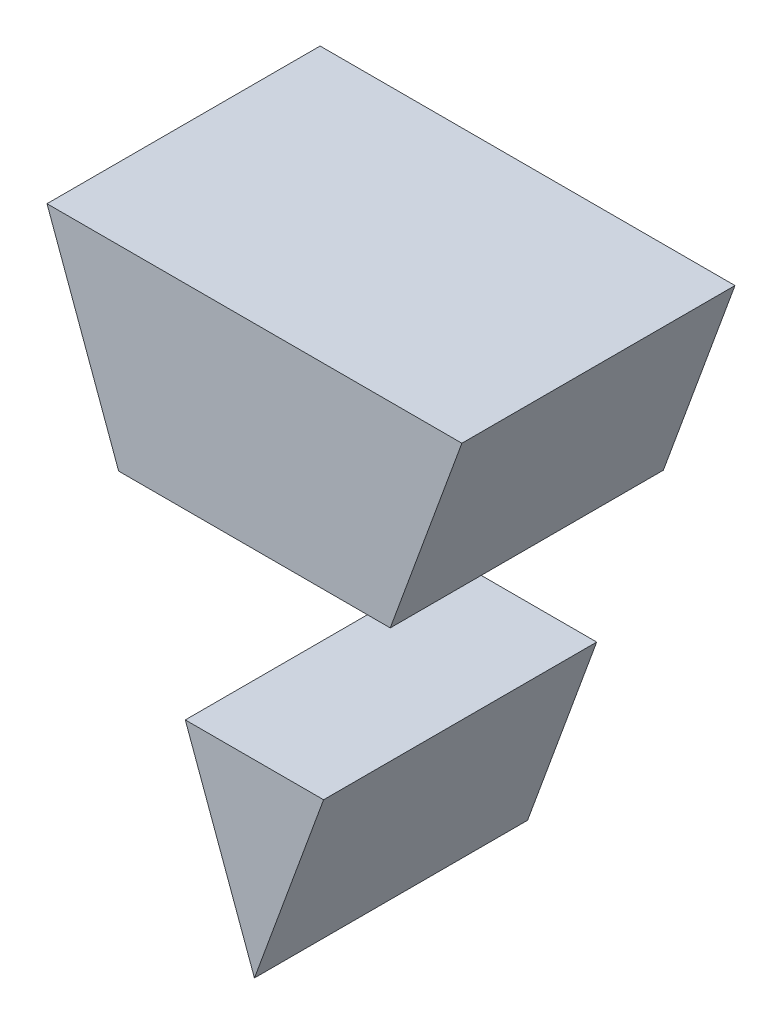
ISO-10303-21;
HEADER;
FILE_DESCRIPTION(('STEP AP214'),'2;1');
FILE_NAME('part.step','',(''),(''),'','','');
FILE_SCHEMA(('AUTOMOTIVE_DESIGN { 1 0 10303 214 1 1 1 1 }'));
ENDSEC;
DATA;
#1=APPLICATION_CONTEXT('core data for automotive mechanical design processes');
#2=APPLICATION_PROTOCOL_DEFINITION('international standard','automotive_design',2000,#1);
#3=PRODUCT_CONTEXT('',#1,'mechanical');
#4=PRODUCT('Part','Part','',(#3));
#5=PRODUCT_RELATED_PRODUCT_CATEGORY('part','',(#4));
#6=PRODUCT_DEFINITION_FORMATION('','',#4);
#7=PRODUCT_DEFINITION_CONTEXT('part definition',#1,'design');
#8=PRODUCT_DEFINITION('design','',#6,#7);
#9=PRODUCT_DEFINITION_SHAPE('','',#8);
#10=(LENGTH_UNIT() NAMED_UNIT(*) SI_UNIT(.MILLI.,.METRE.));
#11=(NAMED_UNIT(*) PLANE_ANGLE_UNIT() SI_UNIT($,.RADIAN.));
#12=(NAMED_UNIT(*) SI_UNIT($,.STERADIAN.) SOLID_ANGLE_UNIT());
#13=UNCERTAINTY_MEASURE_WITH_UNIT(LENGTH_MEASURE(1.E-05),#10,'distance_accuracy_value','');
#14=(GEOMETRIC_REPRESENTATION_CONTEXT(3) GLOBAL_UNCERTAINTY_ASSIGNED_CONTEXT((#13)) GLOBAL_UNIT_ASSIGNED_CONTEXT((#10,
#11,#12)) REPRESENTATION_CONTEXT('',''));
#15=CARTESIAN_POINT('',(0.,0.,0.));
#16=DIRECTION('',(0.,0.,1.));
#17=DIRECTION('',(1.,0.,0.));
#18=AXIS2_PLACEMENT_3D('',#15,#16,#17);
#19=CARTESIAN_POINT('',(-0.09247923496755,-0.06179322686651,0.));
#20=DIRECTION('',(0.,1.,0.));
#21=DIRECTION('',(1.,0.,0.));
#22=AXIS2_PLACEMENT_3D('',#19,#20,#21);
#23=PLANE('',#22);
#24=DIRECTION('',(1.,0.,0.));
#25=VECTOR('',#24,1.);
#26=CARTESIAN_POINT('',(-0.143115988022,-0.06179322686651,0.));
#27=LINE('',#26,#25);
#28=CARTESIAN_POINT('',(-0.143115988022,-0.06179322686651,0.));
#29=VERTEX_POINT('',#28);
#30=CARTESIAN_POINT('',(-0.09247923496755,-0.06179322686651,0.));
#31=VERTEX_POINT('',#30);
#32=EDGE_CURVE('P0_E39',#29,#31,#27,.T.);
#33=ORIENTED_EDGE('',*,*,#32,.F.);
#34=DIRECTION('',(0.,0.,1.));
#35=VECTOR('',#34,1.);
#36=CARTESIAN_POINT('',(-0.143115988022,-0.06179322686651,0.));
#37=LINE('',#36,#35);
#38=CARTESIAN_POINT('',(-0.143115988022,-0.06179322686651,0.1));
#39=VERTEX_POINT('',#38);
#40=EDGE_CURVE('P0_E11',#29,#39,#37,.T.);
#41=ORIENTED_EDGE('',*,*,#40,.T.);
#42=DIRECTION('',(-1.,0.,0.));
#43=VECTOR('',#42,1.);
#44=CARTESIAN_POINT('',(-0.143115988022,-0.06179322686651,0.1));
#45=LINE('',#44,#43);
#46=CARTESIAN_POINT('',(-0.09247923496755,-0.06179322686651,0.1));
#47=VERTEX_POINT('',#46);
#48=EDGE_CURVE('P0_E90',#47,#39,#45,.T.);
#49=ORIENTED_EDGE('',*,*,#48,.F.);
#50=DIRECTION('',(0.,0.,1.));
#51=VECTOR('',#50,1.);
#52=CARTESIAN_POINT('',(-0.09247923496755,-0.06179322686651,0.));
#53=LINE('',#52,#51);
#54=EDGE_CURVE('P0_E26',#31,#47,#53,.T.);
#55=ORIENTED_EDGE('',*,*,#54,.F.);
#56=EDGE_LOOP('',(#33,#41,#49,#55));
#57=FACE_BOUND('',#56,.T.);
#58=ADVANCED_FACE('P0_F16',(#57),#23,.T.);
#59=CARTESIAN_POINT('',(-0.117797611495,-0.130977316953,0.));
#60=DIRECTION('',(0.939091646326967,-0.343666815096988,0.));
#61=DIRECTION('',(0.,0.,-1.));
#62=AXIS2_PLACEMENT_3D('',#59,#60,#61);
#63=PLANE('',#62);
#64=DIRECTION('',(-0.343666815096988,-0.939091646326967,0.));
#65=VECTOR('',#64,1.);
#66=CARTESIAN_POINT('',(-0.09173999406314,-0.05977320361299,0.));
#67=LINE('',#66,#65);
#68=CARTESIAN_POINT('',(-0.117797611495,-0.130977316953,0.));
#69=VERTEX_POINT('',#68);
#70=EDGE_CURVE('P0_E59',#31,#69,#67,.T.);
#71=ORIENTED_EDGE('',*,*,#70,.F.);
#72=ORIENTED_EDGE('',*,*,#54,.T.);
#73=DIRECTION('',(0.343666815096988,0.939091646326967,0.));
#74=VECTOR('',#73,1.);
#75=CARTESIAN_POINT('',(-0.09173999406314,-0.05977320361299,0.1));
#76=LINE('',#75,#74);
#77=CARTESIAN_POINT('',(-0.117797611495,-0.130977316953,0.1));
#78=VERTEX_POINT('',#77);
#79=EDGE_CURVE('P0_E19',#78,#47,#76,.T.);
#80=ORIENTED_EDGE('',*,*,#79,.F.);
#81=DIRECTION('',(0.,0.,1.));
#82=VECTOR('',#81,1.);
#83=CARTESIAN_POINT('',(-0.117797611495,-0.130977316953,0.));
#84=LINE('',#83,#82);
#85=EDGE_CURVE('P0_E70',#69,#78,#84,.T.);
#86=ORIENTED_EDGE('',*,*,#85,.F.);
#87=EDGE_LOOP('',(#71,#72,#80,#86));
#88=FACE_BOUND('',#87,.T.);
#89=ADVANCED_FACE('P0_F71',(#88),#63,.T.);
#90=CARTESIAN_POINT('',(-0.143115988022,-0.06179322686651,0.));
#91=DIRECTION('',(-0.939091646326967,-0.343666815096988,0.));
#92=DIRECTION('',(-0.343666815096988,0.939091646326967,0.));
#93=AXIS2_PLACEMENT_3D('',#90,#91,#92);
#94=PLANE('',#93);
#95=DIRECTION('',(-0.343666815096988,0.939091646326967,0.));
#96=VECTOR('',#95,1.);
#97=CARTESIAN_POINT('',(-0.117797611495,-0.130977316953,0.));
#98=LINE('',#97,#96);
#99=EDGE_CURVE('P0_E63',#69,#29,#98,.T.);
#100=ORIENTED_EDGE('',*,*,#99,.F.);
#101=ORIENTED_EDGE('',*,*,#85,.T.);
#102=DIRECTION('',(0.343666815096988,-0.939091646326967,0.));
#103=VECTOR('',#102,1.);
#104=CARTESIAN_POINT('',(-0.117797611495,-0.130977316953,0.1));
#105=LINE('',#104,#103);
#106=EDGE_CURVE('P0_E67',#39,#78,#105,.T.);
#107=ORIENTED_EDGE('',*,*,#106,.F.);
#108=ORIENTED_EDGE('',*,*,#40,.F.);
#109=EDGE_LOOP('',(#100,#101,#107,#108));
#110=FACE_BOUND('',#109,.T.);
#111=ADVANCED_FACE('P0_F78',(#110),#94,.T.);
#112=CARTESIAN_POINT('',(-0.117797611495,-0.08753773782315,0.));
#113=DIRECTION('',(0.,0.,1.));
#114=DIRECTION('',(1.,0.,0.));
#115=AXIS2_PLACEMENT_3D('',#112,#113,#114);
#116=PLANE('',#115);
#117=ORIENTED_EDGE('',*,*,#99,.T.);
#118=ORIENTED_EDGE('',*,*,#32,.T.);
#119=ORIENTED_EDGE('',*,*,#70,.T.);
#120=EDGE_LOOP('',(#117,#118,#119));
#121=FACE_BOUND('',#120,.T.);
#122=ADVANCED_FACE('P0_F61',(#121),#116,.F.);
#123=CARTESIAN_POINT('',(-0.117797611495,-0.08753773782315,0.1));
#124=DIRECTION('',(0.,0.,1.));
#125=DIRECTION('',(1.,0.,0.));
#126=AXIS2_PLACEMENT_3D('',#123,#124,#125);
#127=PLANE('',#126);
#128=ORIENTED_EDGE('',*,*,#106,.T.);
#129=ORIENTED_EDGE('',*,*,#79,.T.);
#130=ORIENTED_EDGE('',*,*,#48,.T.);
#131=EDGE_LOOP('',(#128,#129,#130));
#132=FACE_BOUND('',#131,.T.);
#133=ADVANCED_FACE('P0_F98',(#132),#127,.T.);
#134=CLOSED_SHELL('',(#58,#89,#111,#122,#133));
#135=MANIFOLD_SOLID_BREP('P0_B1',#134);
#136=CARTESIAN_POINT('',(-0.06807484512104,0.004893335908233,0.));
#137=DIRECTION('',(0.939091646326967,-0.343666815096988,0.));
#138=DIRECTION('',(0.,0.,-1.));
#139=AXIS2_PLACEMENT_3D('',#136,#137,#138);
#140=PLANE('',#139);
#141=DIRECTION('',(0.343666815096988,0.939091646326967,0.));
#142=VECTOR('',#141,1.);
#143=CARTESIAN_POINT('',(-0.06807484512104,0.004893335908233,0.));
#144=LINE('',#143,#142);
#145=CARTESIAN_POINT('',(-0.06807484512104,0.004893335908233,0.));
#146=VERTEX_POINT('',#145);
#147=CARTESIAN_POINT('',(-0.04184248191269,0.07657495330682,0.));
#148=VERTEX_POINT('',#147);
#149=EDGE_CURVE('P1_E11',#146,#148,#144,.T.);
#150=ORIENTED_EDGE('',*,*,#149,.T.);
#151=DIRECTION('',(0.,0.,1.));
#152=VECTOR('',#151,1.);
#153=CARTESIAN_POINT('',(-0.04184248191269,0.07657495330682,0.));
#154=LINE('',#153,#152);
#155=CARTESIAN_POINT('',(-0.04184248191269,0.07657495330682,0.1));
#156=VERTEX_POINT('',#155);
#157=EDGE_CURVE('P1_E20',#148,#156,#154,.T.);
#158=ORIENTED_EDGE('',*,*,#157,.T.);
#159=DIRECTION('',(0.343666815096988,0.939091646326967,0.));
#160=VECTOR('',#159,1.);
#161=CARTESIAN_POINT('',(-0.06807484512104,0.004893335908233,0.1));
#162=LINE('',#161,#160);
#163=CARTESIAN_POINT('',(-0.06807484512104,0.004893335908233,0.1));
#164=VERTEX_POINT('',#163);
#165=EDGE_CURVE('P1_E104',#164,#156,#162,.T.);
#166=ORIENTED_EDGE('',*,*,#165,.F.);
#167=DIRECTION('',(0.,0.,1.));
#168=VECTOR('',#167,1.);
#169=CARTESIAN_POINT('',(-0.06807484512104,0.004893335908233,0.));
#170=LINE('',#169,#168);
#171=EDGE_CURVE('P1_E83',#146,#164,#170,.T.);
#172=ORIENTED_EDGE('',*,*,#171,.F.);
#173=EDGE_LOOP('',(#150,#158,#166,#172));
#174=FACE_BOUND('',#173,.T.);
#175=ADVANCED_FACE('P1_F16',(#174),#140,.T.);
#176=CARTESIAN_POINT('',(-0.167520377869,0.004893335908233,0.));
#177=DIRECTION('',(0.,-1.,0.));
#178=DIRECTION('',(0.,0.,-1.));
#179=AXIS2_PLACEMENT_3D('',#176,#177,#178);
#180=PLANE('',#179);
#181=DIRECTION('',(1.,0.,0.));
#182=VECTOR('',#181,1.);
#183=CARTESIAN_POINT('',(-0.167520377869,0.004893335908233,0.));
#184=LINE('',#183,#182);
#185=CARTESIAN_POINT('',(-0.167520377869,0.004893335908233,0.));
#186=VERTEX_POINT('',#185);
#187=EDGE_CURVE('P1_E81',#186,#146,#184,.T.);
#188=ORIENTED_EDGE('',*,*,#187,.T.);
#189=ORIENTED_EDGE('',*,*,#171,.T.);
#190=DIRECTION('',(1.,0.,0.));
#191=VECTOR('',#190,1.);
#192=CARTESIAN_POINT('',(-0.167520377869,0.004893335908233,0.1));
#193=LINE('',#192,#191);
#194=CARTESIAN_POINT('',(-0.167520377869,0.004893335908233,0.1));
#195=VERTEX_POINT('',#194);
#196=EDGE_CURVE('P1_E101',#195,#164,#193,.T.);
#197=ORIENTED_EDGE('',*,*,#196,.F.);
#198=DIRECTION('',(0.,0.,1.));
#199=VECTOR('',#198,1.);
#200=CARTESIAN_POINT('',(-0.167520377869,0.004893335908233,0.));
#201=LINE('',#200,#199);
#202=EDGE_CURVE('P1_E84',#186,#195,#201,.T.);
#203=ORIENTED_EDGE('',*,*,#202,.F.);
#204=EDGE_LOOP('',(#188,#189,#197,#203));
#205=FACE_BOUND('',#204,.T.);
#206=ADVANCED_FACE('P1_F186',(#205),#180,.T.);
#207=CARTESIAN_POINT('',(-0.193752741077,0.07657495330682,0.));
#208=DIRECTION('',(-0.939091646326967,-0.343666815096988,0.));
#209=DIRECTION('',(-0.343666815096988,0.939091646326967,0.));
#210=AXIS2_PLACEMENT_3D('',#207,#208,#209);
#211=PLANE('',#210);
#212=DIRECTION('',(0.343666815096988,-0.939091646326967,0.));
#213=VECTOR('',#212,1.);
#214=CARTESIAN_POINT('',(-0.193752741077,0.07657495330682,0.));
#215=LINE('',#214,#213);
#216=CARTESIAN_POINT('',(-0.193752741077,0.07657495330682,0.));
#217=VERTEX_POINT('',#216);
#218=EDGE_CURVE('P1_E68',#217,#186,#215,.T.);
#219=ORIENTED_EDGE('',*,*,#218,.T.);
#220=ORIENTED_EDGE('',*,*,#202,.T.);
#221=DIRECTION('',(0.343666815096988,-0.939091646326967,0.));
#222=VECTOR('',#221,1.);
#223=CARTESIAN_POINT('',(-0.193752741077,0.07657495330682,0.1));
#224=LINE('',#223,#222);
#225=CARTESIAN_POINT('',(-0.193752741077,0.07657495330682,0.1));
#226=VERTEX_POINT('',#225);
#227=EDGE_CURVE('P1_E70',#226,#195,#224,.T.);
#228=ORIENTED_EDGE('',*,*,#227,.F.);
#229=DIRECTION('',(0.,0.,1.));
#230=VECTOR('',#229,1.);
#231=CARTESIAN_POINT('',(-0.193752741077,0.07657495330682,0.));
#232=LINE('',#231,#230);
#233=EDGE_CURVE('P1_E64',#217,#226,#232,.T.);
#234=ORIENTED_EDGE('',*,*,#233,.F.);
#235=EDGE_LOOP('',(#219,#220,#228,#234));
#236=FACE_BOUND('',#235,.T.);
#237=ADVANCED_FACE('P1_F66',(#236),#211,.T.);
#238=CARTESIAN_POINT('',(-0.04184248191269,0.07657495330682,0.));
#239=DIRECTION('',(0.,1.,0.));
#240=DIRECTION('',(1.,0.,0.));
#241=AXIS2_PLACEMENT_3D('',#238,#239,#240);
#242=PLANE('',#241);
#243=DIRECTION('',(-1.,0.,0.));
#244=VECTOR('',#243,1.);
#245=CARTESIAN_POINT('',(-0.04184248191269,0.07657495330682,0.));
#246=LINE('',#245,#244);
#247=EDGE_CURVE('P1_E73',#148,#217,#246,.T.);
#248=ORIENTED_EDGE('',*,*,#247,.T.);
#249=ORIENTED_EDGE('',*,*,#233,.T.);
#250=DIRECTION('',(-1.,0.,0.));
#251=VECTOR('',#250,1.);
#252=CARTESIAN_POINT('',(-0.04184248191269,0.07657495330682,0.1));
#253=LINE('',#252,#251);
#254=EDGE_CURVE('P1_E74',#156,#226,#253,.T.);
#255=ORIENTED_EDGE('',*,*,#254,.F.);
#256=ORIENTED_EDGE('',*,*,#157,.F.);
#257=EDGE_LOOP('',(#248,#249,#255,#256));
#258=FACE_BOUND('',#257,.T.);
#259=ADVANCED_FACE('P1_F86',(#258),#242,.T.);
#260=CARTESIAN_POINT('',(-0.117797611495,0.04538834577079,0.1));
#261=DIRECTION('',(0.,0.,1.));
#262=DIRECTION('',(1.,0.,0.));
#263=AXIS2_PLACEMENT_3D('',#260,#261,#262);
#264=PLANE('',#263);
#265=ORIENTED_EDGE('',*,*,#254,.T.);
#266=ORIENTED_EDGE('',*,*,#227,.T.);
#267=ORIENTED_EDGE('',*,*,#196,.T.);
#268=ORIENTED_EDGE('',*,*,#165,.T.);
#269=EDGE_LOOP('',(#265,#266,#267,#268));
#270=FACE_BOUND('',#269,.T.);
#271=ADVANCED_FACE('P1_F113',(#270),#264,.T.);
#272=CARTESIAN_POINT('',(-0.117797611495,0.04538834577079,0.));
#273=DIRECTION('',(0.,0.,1.));
#274=DIRECTION('',(1.,0.,0.));
#275=AXIS2_PLACEMENT_3D('',#272,#273,#274);
#276=PLANE('',#275);
#277=ORIENTED_EDGE('',*,*,#247,.F.);
#278=ORIENTED_EDGE('',*,*,#149,.F.);
#279=ORIENTED_EDGE('',*,*,#187,.F.);
#280=ORIENTED_EDGE('',*,*,#218,.F.);
#281=EDGE_LOOP('',(#277,#278,#279,#280));
#282=FACE_BOUND('',#281,.T.);
#283=ADVANCED_FACE('P1_F18',(#282),#276,.F.);
#284=CLOSED_SHELL('',(#175,#206,#237,#259,#271,#283));
#285=MANIFOLD_SOLID_BREP('P1_B1',#284);
#286=ADVANCED_BREP_SHAPE_REPRESENTATION('',(#18,#135,#285),#14);
#287=SHAPE_DEFINITION_REPRESENTATION(#9,#286);
ENDSEC;
END-ISO-10303-21;
